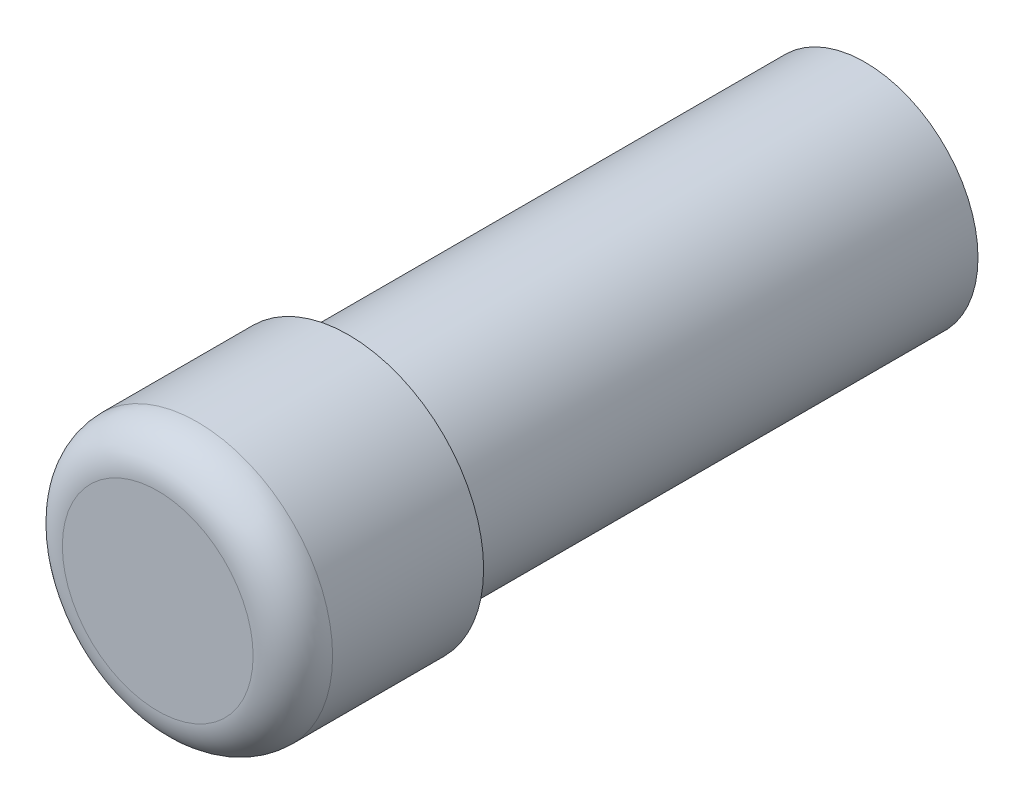
ISO-10303-21;
HEADER;
FILE_DESCRIPTION(('STEP AP214'),'2;1');
FILE_NAME('part.step','',(''),(''),'','','');
FILE_SCHEMA(('AUTOMOTIVE_DESIGN { 1 0 10303 214 1 1 1 1 }'));
ENDSEC;
DATA;
#1=APPLICATION_CONTEXT('core data for automotive mechanical design processes');
#2=APPLICATION_PROTOCOL_DEFINITION('international standard','automotive_design',2000,#1);
#3=PRODUCT_CONTEXT('',#1,'mechanical');
#4=PRODUCT('Part','Part','',(#3));
#5=PRODUCT_RELATED_PRODUCT_CATEGORY('part','',(#4));
#6=PRODUCT_DEFINITION_FORMATION('','',#4);
#7=PRODUCT_DEFINITION_CONTEXT('part definition',#1,'design');
#8=PRODUCT_DEFINITION('design','',#6,#7);
#9=PRODUCT_DEFINITION_SHAPE('','',#8);
#10=(LENGTH_UNIT() NAMED_UNIT(*) SI_UNIT(.MILLI.,.METRE.));
#11=(NAMED_UNIT(*) PLANE_ANGLE_UNIT() SI_UNIT($,.RADIAN.));
#12=(NAMED_UNIT(*) SI_UNIT($,.STERADIAN.) SOLID_ANGLE_UNIT());
#13=UNCERTAINTY_MEASURE_WITH_UNIT(LENGTH_MEASURE(1.E-05),#10,'distance_accuracy_value','');
#14=(GEOMETRIC_REPRESENTATION_CONTEXT(3) GLOBAL_UNCERTAINTY_ASSIGNED_CONTEXT((#13)) GLOBAL_UNIT_ASSIGNED_CONTEXT((#10,
#11,#12)) REPRESENTATION_CONTEXT('',''));
#15=CARTESIAN_POINT('',(0.,0.,0.));
#16=DIRECTION('',(0.,0.,1.));
#17=DIRECTION('',(1.,0.,0.));
#18=AXIS2_PLACEMENT_3D('',#15,#16,#17);
#19=CARTESIAN_POINT('',(0.,0.,-2.65));
#20=DIRECTION('',(0.,0.,1.));
#21=DIRECTION('',(1.,0.,0.));
#22=AXIS2_PLACEMENT_3D('',#19,#20,#21);
#23=PLANE('',#22);
#24=CARTESIAN_POINT('',(0.,0.,-2.65));
#25=DIRECTION('',(0.,0.,1.));
#26=DIRECTION('',(-1.,0.,0.));
#27=AXIS2_PLACEMENT_3D('',#24,#25,#26);
#28=CIRCLE('',#27,3.55);
#29=CARTESIAN_POINT('',(3.55,0.,-2.65));
#30=VERTEX_POINT('',#29);
#31=EDGE_CURVE('E91',#30,#30,#28,.T.);
#32=ORIENTED_EDGE('',*,*,#31,.F.);
#33=EDGE_LOOP('',(#32));
#34=FACE_BOUND('',#33,.T.);
#35=ADVANCED_FACE('F16',(#34),#23,.F.);
#36=CARTESIAN_POINT('',(0.,0.,19.6));
#37=DIRECTION('',(0.,0.,1.));
#38=DIRECTION('',(1.,0.,0.));
#39=AXIS2_PLACEMENT_3D('',#36,#37,#38);
#40=PLANE('',#39);
#41=CARTESIAN_POINT('',(0.,0.,19.6));
#42=DIRECTION('',(0.,0.,-1.));
#43=DIRECTION('',(-1.,0.,0.));
#44=AXIS2_PLACEMENT_3D('',#41,#42,#43);
#45=CIRCLE('',#44,3.);
#46=CARTESIAN_POINT('',(-3.,0.,19.6));
#47=VERTEX_POINT('',#46);
#48=EDGE_CURVE('E87',#47,#47,#45,.T.);
#49=ORIENTED_EDGE('',*,*,#48,.F.);
#50=EDGE_LOOP('',(#49));
#51=FACE_BOUND('',#50,.T.);
#52=ADVANCED_FACE('F108',(#51),#40,.T.);
#53=CARTESIAN_POINT('',(0.,0.,19.6));
#54=DIRECTION('',(0.,0.,-1.));
#55=DIRECTION('',(-1.,0.,0.));
#56=AXIS2_PLACEMENT_3D('',#53,#54,#55);
#57=CYLINDRICAL_SURFACE('',#56,4.25);
#58=CARTESIAN_POINT('',(0.,0.,13.6));
#59=DIRECTION('',(0.,0.,-1.));
#60=DIRECTION('',(-1.,0.,0.));
#61=AXIS2_PLACEMENT_3D('',#58,#59,#60);
#62=CIRCLE('',#61,4.25);
#63=CARTESIAN_POINT('',(4.25,0.,13.6));
#64=VERTEX_POINT('',#63);
#65=EDGE_CURVE('E81',#64,#64,#62,.T.);
#66=ORIENTED_EDGE('',*,*,#65,.F.);
#67=DIRECTION('',(0.,0.,1.));
#68=VECTOR('',#67,1.);
#69=CARTESIAN_POINT('',(4.25,0.,19.6));
#70=LINE('',#69,#68);
#71=CARTESIAN_POINT('',(4.25,0.,18.35));
#72=VERTEX_POINT('',#71);
#73=EDGE_CURVE('E11',#64,#72,#70,.T.);
#74=ORIENTED_EDGE('',*,*,#73,.T.);
#75=CARTESIAN_POINT('',(0.,0.,18.35));
#76=DIRECTION('',(0.,0.,1.));
#77=DIRECTION('',(-1.,0.,0.));
#78=AXIS2_PLACEMENT_3D('',#75,#76,#77);
#79=CIRCLE('',#78,4.25);
#80=CARTESIAN_POINT('',(-4.25,0.,18.35));
#81=VERTEX_POINT('',#80);
#82=EDGE_CURVE('E96',#81,#72,#79,.T.);
#83=ORIENTED_EDGE('',*,*,#82,.F.);
#84=CARTESIAN_POINT('',(0.,0.,18.35));
#85=DIRECTION('',(0.,0.,1.));
#86=DIRECTION('',(-1.,0.,0.));
#87=AXIS2_PLACEMENT_3D('',#84,#85,#86);
#88=CIRCLE('',#87,4.25);
#89=EDGE_CURVE('E26',#72,#81,#88,.T.);
#90=ORIENTED_EDGE('',*,*,#89,.F.);
#91=ORIENTED_EDGE('',*,*,#73,.F.);
#92=EDGE_LOOP('',(#66,#74,#83,#90,#91));
#93=FACE_BOUND('',#92,.T.);
#94=ADVANCED_FACE('F106',(#93),#57,.T.);
#95=CARTESIAN_POINT('',(0.,0.,18.35));
#96=DIRECTION('',(0.,0.,1.));
#97=DIRECTION('',(1.,0.,0.));
#98=AXIS2_PLACEMENT_3D('',#95,#96,#97);
#99=TOROIDAL_SURFACE('',#98,3.,1.25);
#100=ORIENTED_EDGE('',*,*,#48,.T.);
#101=CARTESIAN_POINT('',(-3.,0.,18.35));
#102=DIRECTION('',(0.,-1.,0.));
#103=DIRECTION('',(-1.,0.,0.));
#104=AXIS2_PLACEMENT_3D('',#101,#102,#103);
#105=CIRCLE('',#104,1.25);
#106=EDGE_CURVE('E92',#47,#81,#105,.T.);
#107=ORIENTED_EDGE('',*,*,#106,.T.);
#108=ORIENTED_EDGE('',*,*,#82,.T.);
#109=ORIENTED_EDGE('',*,*,#89,.T.);
#110=ORIENTED_EDGE('',*,*,#106,.F.);
#111=EDGE_LOOP('',(#100,#107,#108,#109,#110));
#112=FACE_BOUND('',#111,.T.);
#113=ADVANCED_FACE('F18',(#112),#99,.T.);
#114=CARTESIAN_POINT('',(0.,0.,-2.65));
#115=DIRECTION('',(0.,0.,1.));
#116=DIRECTION('',(-1.,0.,0.));
#117=AXIS2_PLACEMENT_3D('',#114,#115,#116);
#118=CYLINDRICAL_SURFACE('',#117,3.55);
#119=CARTESIAN_POINT('',(0.,0.,13.4));
#120=DIRECTION('',(0.,0.,1.));
#121=DIRECTION('',(-1.,0.,0.));
#122=AXIS2_PLACEMENT_3D('',#119,#120,#121);
#123=CIRCLE('',#122,3.55);
#124=CARTESIAN_POINT('',(3.55,0.,13.4));
#125=VERTEX_POINT('',#124);
#126=EDGE_CURVE('E74',#125,#125,#123,.T.);
#127=ORIENTED_EDGE('',*,*,#126,.F.);
#128=DIRECTION('',(0.,0.,-1.));
#129=VECTOR('',#128,1.);
#130=CARTESIAN_POINT('',(3.55,0.,-2.65));
#131=LINE('',#130,#129);
#132=EDGE_CURVE('E63',#125,#30,#131,.T.);
#133=ORIENTED_EDGE('',*,*,#132,.T.);
#134=ORIENTED_EDGE('',*,*,#31,.T.);
#135=ORIENTED_EDGE('',*,*,#132,.F.);
#136=EDGE_LOOP('',(#127,#133,#134,#135));
#137=FACE_BOUND('',#136,.T.);
#138=ADVANCED_FACE('F114',(#137),#118,.T.);
#139=CARTESIAN_POINT('',(0.,0.,13.6));
#140=DIRECTION('',(0.,0.,1.));
#141=DIRECTION('',(1.,0.,0.));
#142=AXIS2_PLACEMENT_3D('',#139,#140,#141);
#143=PLANE('',#142);
#144=CARTESIAN_POINT('',(0.,0.,13.6));
#145=DIRECTION('',(0.,0.,-1.));
#146=DIRECTION('',(-1.,0.,0.));
#147=AXIS2_PLACEMENT_3D('',#144,#145,#146);
#148=CIRCLE('',#147,3.75);
#149=CARTESIAN_POINT('',(3.75,0.,13.6));
#150=VERTEX_POINT('',#149);
#151=EDGE_CURVE('E73',#150,#150,#148,.T.);
#152=ORIENTED_EDGE('',*,*,#151,.F.);
#153=EDGE_LOOP('',(#152));
#154=FACE_BOUND('',#153,.T.);
#155=ORIENTED_EDGE('',*,*,#65,.T.);
#156=EDGE_LOOP('',(#155));
#157=FACE_BOUND('',#156,.T.);
#158=ADVANCED_FACE('F127',(#154,#157),#143,.F.);
#159=CARTESIAN_POINT('',(0.,0.,13.4));
#160=DIRECTION('',(0.,0.,-1.));
#161=DIRECTION('',(-1.,0.,0.));
#162=AXIS2_PLACEMENT_3D('',#159,#160,#161);
#163=TOROIDAL_SURFACE('',#162,3.75,0.2);
#164=ORIENTED_EDGE('',*,*,#151,.T.);
#165=CARTESIAN_POINT('',(3.75,0.,13.4));
#166=DIRECTION('',(0.,-1.,0.));
#167=DIRECTION('',(1.,0.,0.));
#168=AXIS2_PLACEMENT_3D('',#165,#166,#167);
#169=CIRCLE('',#168,0.2);
#170=EDGE_CURVE('E70',#150,#125,#169,.T.);
#171=ORIENTED_EDGE('',*,*,#170,.T.);
#172=ORIENTED_EDGE('',*,*,#126,.T.);
#173=ORIENTED_EDGE('',*,*,#170,.F.);
#174=EDGE_LOOP('',(#164,#171,#172,#173));
#175=FACE_BOUND('',#174,.T.);
#176=ADVANCED_FACE('F71',(#175),#163,.F.);
#177=CLOSED_SHELL('',(#35,#52,#94,#113,#138,#158,#176));
#178=MANIFOLD_SOLID_BREP('B1',#177);
#179=ADVANCED_BREP_SHAPE_REPRESENTATION('',(#18,#178),#14);
#180=SHAPE_DEFINITION_REPRESENTATION(#9,#179);
ENDSEC;
END-ISO-10303-21;
